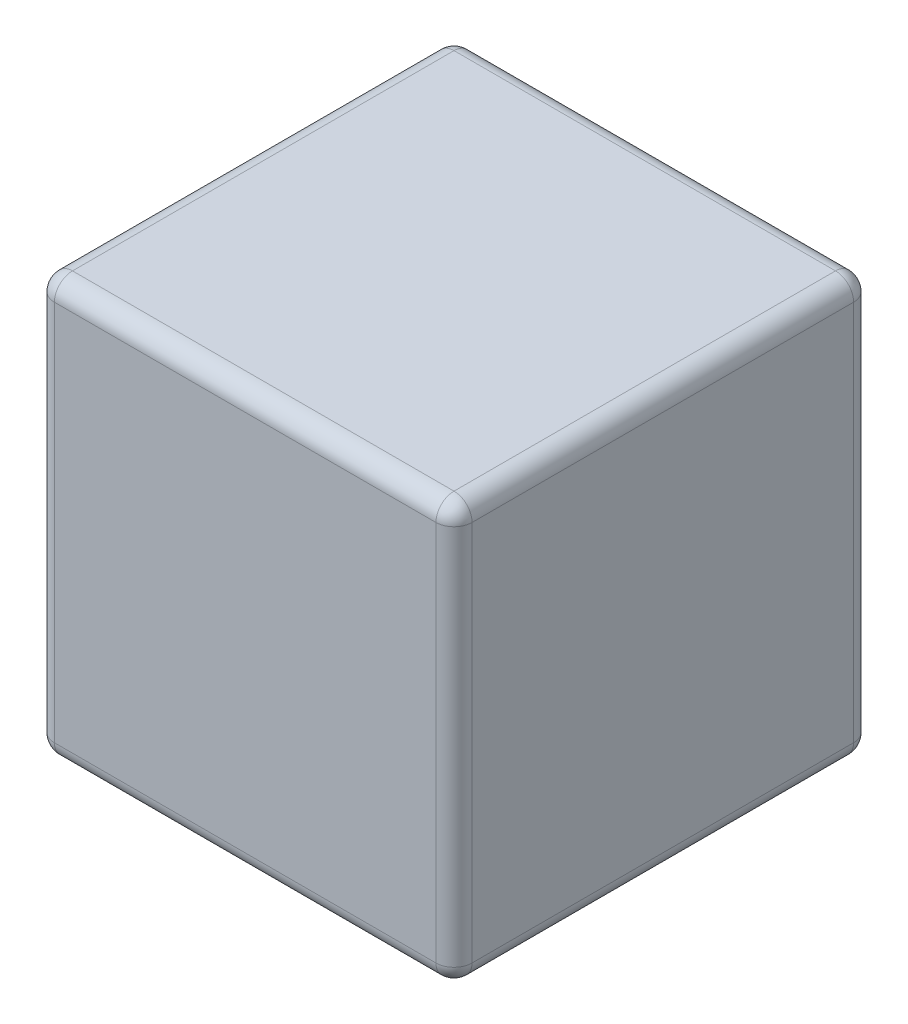
ISO-10303-21;
HEADER;
FILE_DESCRIPTION(('STEP AP214'),'2;1');
FILE_NAME('part.step','',(''),(''),'','','');
FILE_SCHEMA(('AUTOMOTIVE_DESIGN { 1 0 10303 214 1 1 1 1 }'));
ENDSEC;
DATA;
#1=APPLICATION_CONTEXT('core data for automotive mechanical design processes');
#2=APPLICATION_PROTOCOL_DEFINITION('international standard','automotive_design',2000,#1);
#3=PRODUCT_CONTEXT('',#1,'mechanical');
#4=PRODUCT('Part','Part','',(#3));
#5=PRODUCT_RELATED_PRODUCT_CATEGORY('part','',(#4));
#6=PRODUCT_DEFINITION_FORMATION('','',#4);
#7=PRODUCT_DEFINITION_CONTEXT('part definition',#1,'design');
#8=PRODUCT_DEFINITION('design','',#6,#7);
#9=PRODUCT_DEFINITION_SHAPE('','',#8);
#10=(LENGTH_UNIT() NAMED_UNIT(*) SI_UNIT(.MILLI.,.METRE.));
#11=(NAMED_UNIT(*) PLANE_ANGLE_UNIT() SI_UNIT($,.RADIAN.));
#12=(NAMED_UNIT(*) SI_UNIT($,.STERADIAN.) SOLID_ANGLE_UNIT());
#13=UNCERTAINTY_MEASURE_WITH_UNIT(LENGTH_MEASURE(1.E-05),#10,'distance_accuracy_value','');
#14=(GEOMETRIC_REPRESENTATION_CONTEXT(3) GLOBAL_UNCERTAINTY_ASSIGNED_CONTEXT((#13)) GLOBAL_UNIT_ASSIGNED_CONTEXT((#10,
#11,#12)) REPRESENTATION_CONTEXT('',''));
#15=CARTESIAN_POINT('',(0.,0.,0.));
#16=DIRECTION('',(0.,0.,1.));
#17=DIRECTION('',(1.,0.,0.));
#18=AXIS2_PLACEMENT_3D('',#15,#16,#17);
#19=CARTESIAN_POINT('',(5.775,-5.775,11.55));
#20=DIRECTION('',(-1.,0.,0.));
#21=DIRECTION('',(0.,0.,1.));
#22=AXIS2_PLACEMENT_3D('',#19,#20,#21);
#23=PLANE('',#22);
#24=DIRECTION('',(0.,1.,0.));
#25=VECTOR('',#24,1.);
#26=CARTESIAN_POINT('',(5.775,-5.775,11.05));
#27=LINE('',#26,#25);
#28=CARTESIAN_POINT('',(5.775,5.275,11.05));
#29=VERTEX_POINT('',#28);
#30=CARTESIAN_POINT('',(5.775,-5.275,11.05));
#31=VERTEX_POINT('',#30);
#32=EDGE_CURVE('E42',#29,#31,#27,.F.);
#33=ORIENTED_EDGE('',*,*,#32,.T.);
#34=DIRECTION('',(0.,0.,-1.));
#35=VECTOR('',#34,1.);
#36=CARTESIAN_POINT('',(5.775,-5.275,11.55));
#37=LINE('',#36,#35);
#38=CARTESIAN_POINT('',(5.775,-5.275,0.5));
#39=VERTEX_POINT('',#38);
#40=EDGE_CURVE('E11',#31,#39,#37,.T.);
#41=ORIENTED_EDGE('',*,*,#40,.T.);
#42=DIRECTION('',(0.,1.,0.));
#43=VECTOR('',#42,1.);
#44=CARTESIAN_POINT('',(5.775,5.775,0.5));
#45=LINE('',#44,#43);
#46=CARTESIAN_POINT('',(5.775,5.275,0.5));
#47=VERTEX_POINT('',#46);
#48=EDGE_CURVE('E195',#39,#47,#45,.T.);
#49=ORIENTED_EDGE('',*,*,#48,.T.);
#50=DIRECTION('',(0.,0.,-1.));
#51=VECTOR('',#50,1.);
#52=CARTESIAN_POINT('',(5.775,5.275,11.55));
#53=LINE('',#52,#51);
#54=EDGE_CURVE('E53',#47,#29,#53,.F.);
#55=ORIENTED_EDGE('',*,*,#54,.T.);
#56=EDGE_LOOP('',(#33,#41,#49,#55));
#57=FACE_BOUND('',#56,.T.);
#58=ADVANCED_FACE('F33',(#57),#23,.F.);
#59=CARTESIAN_POINT('',(-5.775,5.775,11.55));
#60=DIRECTION('',(0.,-1.,0.));
#61=DIRECTION('',(0.,0.,-1.));
#62=AXIS2_PLACEMENT_3D('',#59,#60,#61);
#63=PLANE('',#62);
#64=DIRECTION('',(-1.,0.,0.));
#65=VECTOR('',#64,1.);
#66=CARTESIAN_POINT('',(-5.775,5.775,0.5));
#67=LINE('',#66,#65);
#68=CARTESIAN_POINT('',(5.275,5.775,0.5));
#69=VERTEX_POINT('',#68);
#70=CARTESIAN_POINT('',(-5.275,5.775,0.5));
#71=VERTEX_POINT('',#70);
#72=EDGE_CURVE('E181',#69,#71,#67,.T.);
#73=ORIENTED_EDGE('',*,*,#72,.T.);
#74=DIRECTION('',(0.,0.,-1.));
#75=VECTOR('',#74,1.);
#76=CARTESIAN_POINT('',(-5.275,5.775,11.55));
#77=LINE('',#76,#75);
#78=CARTESIAN_POINT('',(-5.275,5.775,11.05));
#79=VERTEX_POINT('',#78);
#80=EDGE_CURVE('E183',#71,#79,#77,.F.);
#81=ORIENTED_EDGE('',*,*,#80,.T.);
#82=DIRECTION('',(-1.,0.,0.));
#83=VECTOR('',#82,1.);
#84=CARTESIAN_POINT('',(-5.775,5.775,11.05));
#85=LINE('',#84,#83);
#86=CARTESIAN_POINT('',(5.275,5.775,11.05));
#87=VERTEX_POINT('',#86);
#88=EDGE_CURVE('E179',#79,#87,#85,.F.);
#89=ORIENTED_EDGE('',*,*,#88,.T.);
#90=DIRECTION('',(0.,0.,-1.));
#91=VECTOR('',#90,1.);
#92=CARTESIAN_POINT('',(5.275,5.775,11.55));
#93=LINE('',#92,#91);
#94=EDGE_CURVE('E177',#87,#69,#93,.T.);
#95=ORIENTED_EDGE('',*,*,#94,.T.);
#96=EDGE_LOOP('',(#73,#81,#89,#95));
#97=FACE_BOUND('',#96,.T.);
#98=ADVANCED_FACE('F266',(#97),#63,.F.);
#99=CARTESIAN_POINT('',(-5.775,-5.775,11.55));
#100=DIRECTION('',(1.,0.,0.));
#101=DIRECTION('',(0.,0.,-1.));
#102=AXIS2_PLACEMENT_3D('',#99,#100,#101);
#103=PLANE('',#102);
#104=DIRECTION('',(0.,-1.,0.));
#105=VECTOR('',#104,1.);
#106=CARTESIAN_POINT('',(-5.775,-5.775,0.5));
#107=LINE('',#106,#105);
#108=CARTESIAN_POINT('',(-5.775,5.275,0.5));
#109=VERTEX_POINT('',#108);
#110=CARTESIAN_POINT('',(-5.775,-5.275,0.5));
#111=VERTEX_POINT('',#110);
#112=EDGE_CURVE('E172',#109,#111,#107,.T.);
#113=ORIENTED_EDGE('',*,*,#112,.T.);
#114=DIRECTION('',(0.,0.,-1.));
#115=VECTOR('',#114,1.);
#116=CARTESIAN_POINT('',(-5.775,-5.275,11.55));
#117=LINE('',#116,#115);
#118=CARTESIAN_POINT('',(-5.775,-5.275,11.05));
#119=VERTEX_POINT('',#118);
#120=EDGE_CURVE('E174',#111,#119,#117,.F.);
#121=ORIENTED_EDGE('',*,*,#120,.T.);
#122=DIRECTION('',(0.,-1.,0.));
#123=VECTOR('',#122,1.);
#124=CARTESIAN_POINT('',(-5.775,-5.775,11.05));
#125=LINE('',#124,#123);
#126=CARTESIAN_POINT('',(-5.775,5.275,11.05));
#127=VERTEX_POINT('',#126);
#128=EDGE_CURVE('E168',#119,#127,#125,.F.);
#129=ORIENTED_EDGE('',*,*,#128,.T.);
#130=DIRECTION('',(0.,0.,-1.));
#131=VECTOR('',#130,1.);
#132=CARTESIAN_POINT('',(-5.775,5.275,11.55));
#133=LINE('',#132,#131);
#134=EDGE_CURVE('E170',#127,#109,#133,.T.);
#135=ORIENTED_EDGE('',*,*,#134,.T.);
#136=EDGE_LOOP('',(#113,#121,#129,#135));
#137=FACE_BOUND('',#136,.T.);
#138=ADVANCED_FACE('F287',(#137),#103,.F.);
#139=CARTESIAN_POINT('',(-5.775,-5.775,11.55));
#140=DIRECTION('',(0.,1.,0.));
#141=DIRECTION('',(0.,0.,1.));
#142=AXIS2_PLACEMENT_3D('',#139,#140,#141);
#143=PLANE('',#142);
#144=DIRECTION('',(0.,0.,-1.));
#145=VECTOR('',#144,1.);
#146=CARTESIAN_POINT('',(-5.275,-5.775,11.55));
#147=LINE('',#146,#145);
#148=CARTESIAN_POINT('',(-5.275,-5.775,11.05));
#149=VERTEX_POINT('',#148);
#150=CARTESIAN_POINT('',(-5.275,-5.775,0.5));
#151=VERTEX_POINT('',#150);
#152=EDGE_CURVE('E155',#149,#151,#147,.T.);
#153=ORIENTED_EDGE('',*,*,#152,.T.);
#154=DIRECTION('',(1.,0.,0.));
#155=VECTOR('',#154,1.);
#156=CARTESIAN_POINT('',(5.775,-5.775,0.5));
#157=LINE('',#156,#155);
#158=CARTESIAN_POINT('',(5.275,-5.775,0.5));
#159=VERTEX_POINT('',#158);
#160=EDGE_CURVE('E127',#151,#159,#157,.T.);
#161=ORIENTED_EDGE('',*,*,#160,.T.);
#162=DIRECTION('',(0.,0.,-1.));
#163=VECTOR('',#162,1.);
#164=CARTESIAN_POINT('',(5.275,-5.775,11.55));
#165=LINE('',#164,#163);
#166=CARTESIAN_POINT('',(5.275,-5.775,11.05));
#167=VERTEX_POINT('',#166);
#168=EDGE_CURVE('E145',#159,#167,#165,.F.);
#169=ORIENTED_EDGE('',*,*,#168,.T.);
#170=DIRECTION('',(1.,0.,0.));
#171=VECTOR('',#170,1.);
#172=CARTESIAN_POINT('',(-5.775,-5.775,11.05));
#173=LINE('',#172,#171);
#174=EDGE_CURVE('E151',#167,#149,#173,.F.);
#175=ORIENTED_EDGE('',*,*,#174,.T.);
#176=EDGE_LOOP('',(#153,#161,#169,#175));
#177=FACE_BOUND('',#176,.T.);
#178=ADVANCED_FACE('F153',(#177),#143,.F.);
#179=CARTESIAN_POINT('',(0.,0.,11.55));
#180=DIRECTION('',(0.,0.,-1.));
#181=DIRECTION('',(-1.,0.,0.));
#182=AXIS2_PLACEMENT_3D('',#179,#180,#181);
#183=PLANE('',#182);
#184=DIRECTION('',(0.,-1.,0.));
#185=VECTOR('',#184,1.);
#186=CARTESIAN_POINT('',(-5.275,0.,11.55));
#187=LINE('',#186,#185);
#188=CARTESIAN_POINT('',(-5.275,5.275,11.55));
#189=VERTEX_POINT('',#188);
#190=CARTESIAN_POINT('',(-5.275,-5.275,11.55));
#191=VERTEX_POINT('',#190);
#192=EDGE_CURVE('E190',#189,#191,#187,.T.);
#193=ORIENTED_EDGE('',*,*,#192,.T.);
#194=DIRECTION('',(1.,0.,0.));
#195=VECTOR('',#194,1.);
#196=CARTESIAN_POINT('',(0.,-5.275,11.55));
#197=LINE('',#196,#195);
#198=CARTESIAN_POINT('',(5.275,-5.275,11.55));
#199=VERTEX_POINT('',#198);
#200=EDGE_CURVE('E192',#191,#199,#197,.T.);
#201=ORIENTED_EDGE('',*,*,#200,.T.);
#202=DIRECTION('',(0.,1.,0.));
#203=VECTOR('',#202,1.);
#204=CARTESIAN_POINT('',(5.275,0.,11.55));
#205=LINE('',#204,#203);
#206=CARTESIAN_POINT('',(5.275,5.275,11.55));
#207=VERTEX_POINT('',#206);
#208=EDGE_CURVE('E186',#199,#207,#205,.T.);
#209=ORIENTED_EDGE('',*,*,#208,.T.);
#210=DIRECTION('',(-1.,0.,0.));
#211=VECTOR('',#210,1.);
#212=CARTESIAN_POINT('',(0.,5.275,11.55));
#213=LINE('',#212,#211);
#214=EDGE_CURVE('E188',#207,#189,#213,.T.);
#215=ORIENTED_EDGE('',*,*,#214,.T.);
#216=EDGE_LOOP('',(#193,#201,#209,#215));
#217=FACE_BOUND('',#216,.T.);
#218=ADVANCED_FACE('F301',(#217),#183,.F.);
#219=CARTESIAN_POINT('',(0.,0.,0.));
#220=DIRECTION('',(0.,0.,-1.));
#221=DIRECTION('',(-1.,0.,0.));
#222=AXIS2_PLACEMENT_3D('',#219,#220,#221);
#223=PLANE('',#222);
#224=DIRECTION('',(0.,1.,0.));
#225=VECTOR('',#224,1.);
#226=CARTESIAN_POINT('',(5.275,-5.775,0.));
#227=LINE('',#226,#225);
#228=CARTESIAN_POINT('',(5.275,5.275,0.));
#229=VERTEX_POINT('',#228);
#230=CARTESIAN_POINT('',(5.275,-5.275,0.));
#231=VERTEX_POINT('',#230);
#232=EDGE_CURVE('E157',#229,#231,#227,.F.);
#233=ORIENTED_EDGE('',*,*,#232,.T.);
#234=DIRECTION('',(1.,0.,0.));
#235=VECTOR('',#234,1.);
#236=CARTESIAN_POINT('',(-5.775,-5.275,0.));
#237=LINE('',#236,#235);
#238=CARTESIAN_POINT('',(-5.275,-5.275,0.));
#239=VERTEX_POINT('',#238);
#240=EDGE_CURVE('E129',#231,#239,#237,.F.);
#241=ORIENTED_EDGE('',*,*,#240,.T.);
#242=DIRECTION('',(0.,-1.,0.));
#243=VECTOR('',#242,1.);
#244=CARTESIAN_POINT('',(-5.275,5.775,0.));
#245=LINE('',#244,#243);
#246=CARTESIAN_POINT('',(-5.275,5.275,0.));
#247=VERTEX_POINT('',#246);
#248=EDGE_CURVE('E165',#239,#247,#245,.F.);
#249=ORIENTED_EDGE('',*,*,#248,.T.);
#250=DIRECTION('',(-1.,0.,0.));
#251=VECTOR('',#250,1.);
#252=CARTESIAN_POINT('',(5.775,5.275,0.));
#253=LINE('',#252,#251);
#254=EDGE_CURVE('E159',#247,#229,#253,.F.);
#255=ORIENTED_EDGE('',*,*,#254,.T.);
#256=EDGE_LOOP('',(#233,#241,#249,#255));
#257=FACE_BOUND('',#256,.T.);
#258=ADVANCED_FACE('F320',(#257),#223,.T.);
#259=CARTESIAN_POINT('',(0.,5.275,11.05));
#260=DIRECTION('',(-1.,0.,0.));
#261=DIRECTION('',(0.,0.,1.));
#262=AXIS2_PLACEMENT_3D('',#259,#260,#261);
#263=CYLINDRICAL_SURFACE('',#262,0.5);
#264=CARTESIAN_POINT('',(-5.275,5.275,11.05));
#265=DIRECTION('',(-1.,0.,0.));
#266=DIRECTION('',(0.,0.,1.));
#267=AXIS2_PLACEMENT_3D('',#264,#265,#266);
#268=CIRCLE('',#267,0.5);
#269=EDGE_CURVE('E37',#189,#79,#268,.T.);
#270=ORIENTED_EDGE('',*,*,#269,.F.);
#271=ORIENTED_EDGE('',*,*,#214,.F.);
#272=CARTESIAN_POINT('',(5.275,5.275,11.05));
#273=DIRECTION('',(1.,0.,0.));
#274=DIRECTION('',(0.,0.,-1.));
#275=AXIS2_PLACEMENT_3D('',#272,#273,#274);
#276=CIRCLE('',#275,0.5);
#277=EDGE_CURVE('E247',#87,#207,#276,.T.);
#278=ORIENTED_EDGE('',*,*,#277,.F.);
#279=ORIENTED_EDGE('',*,*,#88,.F.);
#280=EDGE_LOOP('',(#270,#271,#278,#279));
#281=FACE_BOUND('',#280,.T.);
#282=ADVANCED_FACE('F35',(#281),#263,.T.);
#283=CARTESIAN_POINT('',(-5.275,5.275,11.05));
#284=DIRECTION('',(0.,0.,1.));
#285=DIRECTION('',(1.,0.,0.));
#286=AXIS2_PLACEMENT_3D('',#283,#284,#285);
#287=SPHERICAL_SURFACE('',#286,0.5);
#288=CARTESIAN_POINT('',(-5.275,5.275,11.05));
#289=DIRECTION('',(0.,1.,0.));
#290=DIRECTION('',(0.,0.,1.));
#291=AXIS2_PLACEMENT_3D('',#288,#289,#290);
#292=CIRCLE('',#291,0.5);
#293=EDGE_CURVE('E243',#189,#127,#292,.F.);
#294=ORIENTED_EDGE('',*,*,#293,.F.);
#295=ORIENTED_EDGE('',*,*,#269,.T.);
#296=CARTESIAN_POINT('',(-5.275,5.275,11.05));
#297=DIRECTION('',(0.,0.,1.));
#298=DIRECTION('',(1.,0.,0.));
#299=AXIS2_PLACEMENT_3D('',#296,#297,#298);
#300=CIRCLE('',#299,0.5);
#301=EDGE_CURVE('E246',#127,#79,#300,.F.);
#302=ORIENTED_EDGE('',*,*,#301,.F.);
#303=EDGE_LOOP('',(#294,#295,#302));
#304=FACE_BOUND('',#303,.T.);
#305=ADVANCED_FACE('F259',(#304),#287,.T.);
#306=CARTESIAN_POINT('',(5.275,5.275,11.05));
#307=DIRECTION('',(0.,0.,1.));
#308=DIRECTION('',(1.,0.,0.));
#309=AXIS2_PLACEMENT_3D('',#306,#307,#308);
#310=SPHERICAL_SURFACE('',#309,0.5);
#311=CARTESIAN_POINT('',(5.275,5.275,11.05));
#312=DIRECTION('',(0.,0.,1.));
#313=DIRECTION('',(1.,0.,0.));
#314=AXIS2_PLACEMENT_3D('',#311,#312,#313);
#315=CIRCLE('',#314,0.5);
#316=EDGE_CURVE('E238',#87,#29,#315,.F.);
#317=ORIENTED_EDGE('',*,*,#316,.F.);
#318=ORIENTED_EDGE('',*,*,#277,.T.);
#319=CARTESIAN_POINT('',(5.275,5.275,11.05));
#320=DIRECTION('',(0.,1.,0.));
#321=DIRECTION('',(0.,0.,1.));
#322=AXIS2_PLACEMENT_3D('',#319,#320,#321);
#323=CIRCLE('',#322,0.5);
#324=EDGE_CURVE('E240',#29,#207,#323,.F.);
#325=ORIENTED_EDGE('',*,*,#324,.F.);
#326=EDGE_LOOP('',(#317,#318,#325));
#327=FACE_BOUND('',#326,.T.);
#328=ADVANCED_FACE('F309',(#327),#310,.T.);
#329=CARTESIAN_POINT('',(-5.275,5.275,11.55));
#330=DIRECTION('',(0.,0.,-1.));
#331=DIRECTION('',(-1.,0.,0.));
#332=AXIS2_PLACEMENT_3D('',#329,#330,#331);
#333=CYLINDRICAL_SURFACE('',#332,0.5);
#334=ORIENTED_EDGE('',*,*,#301,.T.);
#335=ORIENTED_EDGE('',*,*,#80,.F.);
#336=CARTESIAN_POINT('',(-5.275,5.275,0.5));
#337=DIRECTION('',(0.,0.,-1.));
#338=DIRECTION('',(-1.,0.,0.));
#339=AXIS2_PLACEMENT_3D('',#336,#337,#338);
#340=CIRCLE('',#339,0.5);
#341=EDGE_CURVE('E232',#109,#71,#340,.T.);
#342=ORIENTED_EDGE('',*,*,#341,.F.);
#343=ORIENTED_EDGE('',*,*,#134,.F.);
#344=EDGE_LOOP('',(#334,#335,#342,#343));
#345=FACE_BOUND('',#344,.T.);
#346=ADVANCED_FACE('F271',(#345),#333,.T.);
#347=CARTESIAN_POINT('',(-5.275,0.,11.05));
#348=DIRECTION('',(0.,-1.,0.));
#349=DIRECTION('',(0.,0.,-1.));
#350=AXIS2_PLACEMENT_3D('',#347,#348,#349);
#351=CYLINDRICAL_SURFACE('',#350,0.5);
#352=ORIENTED_EDGE('',*,*,#293,.T.);
#353=ORIENTED_EDGE('',*,*,#128,.F.);
#354=CARTESIAN_POINT('',(-5.275,-5.275,11.05));
#355=DIRECTION('',(0.,-1.,0.));
#356=DIRECTION('',(0.,0.,-1.));
#357=AXIS2_PLACEMENT_3D('',#354,#355,#356);
#358=CIRCLE('',#357,0.5);
#359=EDGE_CURVE('E229',#191,#119,#358,.T.);
#360=ORIENTED_EDGE('',*,*,#359,.F.);
#361=ORIENTED_EDGE('',*,*,#192,.F.);
#362=EDGE_LOOP('',(#352,#353,#360,#361));
#363=FACE_BOUND('',#362,.T.);
#364=ADVANCED_FACE('F298',(#363),#351,.T.);
#365=CARTESIAN_POINT('',(0.,-5.275,11.05));
#366=DIRECTION('',(1.,0.,0.));
#367=DIRECTION('',(0.,0.,-1.));
#368=AXIS2_PLACEMENT_3D('',#365,#366,#367);
#369=CYLINDRICAL_SURFACE('',#368,0.5);
#370=CARTESIAN_POINT('',(5.275,-5.275,11.05));
#371=DIRECTION('',(1.,0.,0.));
#372=DIRECTION('',(0.,0.,-1.));
#373=AXIS2_PLACEMENT_3D('',#370,#371,#372);
#374=CIRCLE('',#373,0.5);
#375=EDGE_CURVE('E223',#199,#167,#374,.T.);
#376=ORIENTED_EDGE('',*,*,#375,.F.);
#377=ORIENTED_EDGE('',*,*,#200,.F.);
#378=CARTESIAN_POINT('',(-5.275,-5.275,11.05));
#379=DIRECTION('',(-1.,0.,0.));
#380=DIRECTION('',(0.,0.,1.));
#381=AXIS2_PLACEMENT_3D('',#378,#379,#380);
#382=CIRCLE('',#381,0.5);
#383=EDGE_CURVE('E226',#149,#191,#382,.T.);
#384=ORIENTED_EDGE('',*,*,#383,.F.);
#385=ORIENTED_EDGE('',*,*,#174,.F.);
#386=EDGE_LOOP('',(#376,#377,#384,#385));
#387=FACE_BOUND('',#386,.T.);
#388=ADVANCED_FACE('F304',(#387),#369,.T.);
#389=CARTESIAN_POINT('',(5.275,0.,11.05));
#390=DIRECTION('',(0.,1.,0.));
#391=DIRECTION('',(0.,0.,1.));
#392=AXIS2_PLACEMENT_3D('',#389,#390,#391);
#393=CYLINDRICAL_SURFACE('',#392,0.5);
#394=ORIENTED_EDGE('',*,*,#324,.T.);
#395=ORIENTED_EDGE('',*,*,#208,.F.);
#396=CARTESIAN_POINT('',(5.275,-5.275,11.05));
#397=DIRECTION('',(0.,-1.,0.));
#398=DIRECTION('',(0.,0.,-1.));
#399=AXIS2_PLACEMENT_3D('',#396,#397,#398);
#400=CIRCLE('',#399,0.5);
#401=EDGE_CURVE('E221',#31,#199,#400,.T.);
#402=ORIENTED_EDGE('',*,*,#401,.F.);
#403=ORIENTED_EDGE('',*,*,#32,.F.);
#404=EDGE_LOOP('',(#394,#395,#402,#403));
#405=FACE_BOUND('',#404,.T.);
#406=ADVANCED_FACE('F308',(#405),#393,.T.);
#407=CARTESIAN_POINT('',(5.275,5.275,11.55));
#408=DIRECTION('',(0.,0.,-1.));
#409=DIRECTION('',(-1.,0.,0.));
#410=AXIS2_PLACEMENT_3D('',#407,#408,#409);
#411=CYLINDRICAL_SURFACE('',#410,0.5);
#412=ORIENTED_EDGE('',*,*,#316,.T.);
#413=ORIENTED_EDGE('',*,*,#54,.F.);
#414=CARTESIAN_POINT('',(5.275,5.275,0.5));
#415=DIRECTION('',(0.,0.,-1.));
#416=DIRECTION('',(-1.,0.,0.));
#417=AXIS2_PLACEMENT_3D('',#414,#415,#416);
#418=CIRCLE('',#417,0.5);
#419=EDGE_CURVE('E218',#69,#47,#418,.T.);
#420=ORIENTED_EDGE('',*,*,#419,.F.);
#421=ORIENTED_EDGE('',*,*,#94,.F.);
#422=EDGE_LOOP('',(#412,#413,#420,#421));
#423=FACE_BOUND('',#422,.T.);
#424=ADVANCED_FACE('F312',(#423),#411,.T.);
#425=CARTESIAN_POINT('',(-5.775,5.275,0.5));
#426=DIRECTION('',(1.,0.,0.));
#427=DIRECTION('',(0.,0.,-1.));
#428=AXIS2_PLACEMENT_3D('',#425,#426,#427);
#429=CYLINDRICAL_SURFACE('',#428,0.5);
#430=CARTESIAN_POINT('',(-5.275,5.275,0.5));
#431=DIRECTION('',(-1.,0.,0.));
#432=DIRECTION('',(0.,0.,1.));
#433=AXIS2_PLACEMENT_3D('',#430,#431,#432);
#434=CIRCLE('',#433,0.5);
#435=EDGE_CURVE('E235',#71,#247,#434,.T.);
#436=ORIENTED_EDGE('',*,*,#435,.F.);
#437=ORIENTED_EDGE('',*,*,#72,.F.);
#438=CARTESIAN_POINT('',(5.275,5.275,0.5));
#439=DIRECTION('',(1.,0.,0.));
#440=DIRECTION('',(0.,1.,0.));
#441=AXIS2_PLACEMENT_3D('',#438,#439,#440);
#442=CIRCLE('',#441,0.5);
#443=EDGE_CURVE('E215',#229,#69,#442,.T.);
#444=ORIENTED_EDGE('',*,*,#443,.F.);
#445=ORIENTED_EDGE('',*,*,#254,.F.);
#446=EDGE_LOOP('',(#436,#437,#444,#445));
#447=FACE_BOUND('',#446,.T.);
#448=ADVANCED_FACE('F275',(#447),#429,.T.);
#449=CARTESIAN_POINT('',(-5.275,5.275,0.5));
#450=DIRECTION('',(0.,0.,1.));
#451=DIRECTION('',(1.,0.,0.));
#452=AXIS2_PLACEMENT_3D('',#449,#450,#451);
#453=SPHERICAL_SURFACE('',#452,0.5);
#454=ORIENTED_EDGE('',*,*,#341,.T.);
#455=ORIENTED_EDGE('',*,*,#435,.T.);
#456=CARTESIAN_POINT('',(-5.275,5.275,0.5));
#457=DIRECTION('',(0.,1.,0.));
#458=DIRECTION('',(-1.,0.,0.));
#459=AXIS2_PLACEMENT_3D('',#456,#457,#458);
#460=CIRCLE('',#459,0.5);
#461=EDGE_CURVE('E212',#109,#247,#460,.F.);
#462=ORIENTED_EDGE('',*,*,#461,.F.);
#463=EDGE_LOOP('',(#454,#455,#462));
#464=FACE_BOUND('',#463,.T.);
#465=ADVANCED_FACE('F279',(#464),#453,.T.);
#466=CARTESIAN_POINT('',(-5.275,-5.275,11.05));
#467=DIRECTION('',(0.,0.,1.));
#468=DIRECTION('',(1.,0.,0.));
#469=AXIS2_PLACEMENT_3D('',#466,#467,#468);
#470=SPHERICAL_SURFACE('',#469,0.5);
#471=ORIENTED_EDGE('',*,*,#383,.T.);
#472=ORIENTED_EDGE('',*,*,#359,.T.);
#473=CARTESIAN_POINT('',(-5.275,-5.275,11.05));
#474=DIRECTION('',(0.,0.,1.));
#475=DIRECTION('',(1.,0.,0.));
#476=AXIS2_PLACEMENT_3D('',#473,#474,#475);
#477=CIRCLE('',#476,0.5);
#478=EDGE_CURVE('E210',#149,#119,#477,.F.);
#479=ORIENTED_EDGE('',*,*,#478,.F.);
#480=EDGE_LOOP('',(#471,#472,#479));
#481=FACE_BOUND('',#480,.T.);
#482=ADVANCED_FACE('F295',(#481),#470,.T.);
#483=CARTESIAN_POINT('',(5.275,-5.275,11.05));
#484=DIRECTION('',(0.,0.,1.));
#485=DIRECTION('',(1.,0.,0.));
#486=AXIS2_PLACEMENT_3D('',#483,#484,#485);
#487=SPHERICAL_SURFACE('',#486,0.5);
#488=ORIENTED_EDGE('',*,*,#401,.T.);
#489=ORIENTED_EDGE('',*,*,#375,.T.);
#490=CARTESIAN_POINT('',(5.275,-5.275,11.05));
#491=DIRECTION('',(0.,0.,1.));
#492=DIRECTION('',(1.,0.,0.));
#493=AXIS2_PLACEMENT_3D('',#490,#491,#492);
#494=CIRCLE('',#493,0.5);
#495=EDGE_CURVE('E148',#31,#167,#494,.F.);
#496=ORIENTED_EDGE('',*,*,#495,.F.);
#497=EDGE_LOOP('',(#488,#489,#496));
#498=FACE_BOUND('',#497,.T.);
#499=ADVANCED_FACE('F355',(#498),#487,.T.);
#500=CARTESIAN_POINT('',(5.275,5.275,0.5));
#501=DIRECTION('',(0.,0.,1.));
#502=DIRECTION('',(1.,0.,0.));
#503=AXIS2_PLACEMENT_3D('',#500,#501,#502);
#504=SPHERICAL_SURFACE('',#503,0.5);
#505=ORIENTED_EDGE('',*,*,#443,.T.);
#506=ORIENTED_EDGE('',*,*,#419,.T.);
#507=CARTESIAN_POINT('',(5.275,5.275,0.5));
#508=DIRECTION('',(0.,1.,0.));
#509=DIRECTION('',(0.,0.,1.));
#510=AXIS2_PLACEMENT_3D('',#507,#508,#509);
#511=CIRCLE('',#510,0.5);
#512=EDGE_CURVE('E206',#229,#47,#511,.F.);
#513=ORIENTED_EDGE('',*,*,#512,.F.);
#514=EDGE_LOOP('',(#505,#506,#513));
#515=FACE_BOUND('',#514,.T.);
#516=ADVANCED_FACE('F315',(#515),#504,.T.);
#517=CARTESIAN_POINT('',(-5.275,-5.775,0.5));
#518=DIRECTION('',(0.,1.,0.));
#519=DIRECTION('',(0.,0.,1.));
#520=AXIS2_PLACEMENT_3D('',#517,#518,#519);
#521=CYLINDRICAL_SURFACE('',#520,0.5);
#522=ORIENTED_EDGE('',*,*,#461,.T.);
#523=ORIENTED_EDGE('',*,*,#248,.F.);
#524=CARTESIAN_POINT('',(-5.275,-5.275,0.5));
#525=DIRECTION('',(0.,-1.,0.));
#526=DIRECTION('',(0.,0.,-1.));
#527=AXIS2_PLACEMENT_3D('',#524,#525,#526);
#528=CIRCLE('',#527,0.5);
#529=EDGE_CURVE('E203',#111,#239,#528,.T.);
#530=ORIENTED_EDGE('',*,*,#529,.F.);
#531=ORIENTED_EDGE('',*,*,#112,.F.);
#532=EDGE_LOOP('',(#522,#523,#530,#531));
#533=FACE_BOUND('',#532,.T.);
#534=ADVANCED_FACE('F284',(#533),#521,.T.);
#535=CARTESIAN_POINT('',(-5.275,-5.275,11.55));
#536=DIRECTION('',(0.,0.,-1.));
#537=DIRECTION('',(-1.,0.,0.));
#538=AXIS2_PLACEMENT_3D('',#535,#536,#537);
#539=CYLINDRICAL_SURFACE('',#538,0.5);
#540=ORIENTED_EDGE('',*,*,#478,.T.);
#541=ORIENTED_EDGE('',*,*,#120,.F.);
#542=CARTESIAN_POINT('',(-5.275,-5.275,0.5));
#543=DIRECTION('',(0.,0.,-1.));
#544=DIRECTION('',(-1.,0.,0.));
#545=AXIS2_PLACEMENT_3D('',#542,#543,#544);
#546=CIRCLE('',#545,0.5);
#547=EDGE_CURVE('E142',#151,#111,#546,.T.);
#548=ORIENTED_EDGE('',*,*,#547,.F.);
#549=ORIENTED_EDGE('',*,*,#152,.F.);
#550=EDGE_LOOP('',(#540,#541,#548,#549));
#551=FACE_BOUND('',#550,.T.);
#552=ADVANCED_FACE('F289',(#551),#539,.T.);
#553=CARTESIAN_POINT('',(5.275,-5.275,11.55));
#554=DIRECTION('',(0.,0.,-1.));
#555=DIRECTION('',(-1.,0.,0.));
#556=AXIS2_PLACEMENT_3D('',#553,#554,#555);
#557=CYLINDRICAL_SURFACE('',#556,0.5);
#558=ORIENTED_EDGE('',*,*,#495,.T.);
#559=ORIENTED_EDGE('',*,*,#168,.F.);
#560=CARTESIAN_POINT('',(5.275,-5.275,0.5));
#561=DIRECTION('',(0.,0.,-1.));
#562=DIRECTION('',(-1.,0.,0.));
#563=AXIS2_PLACEMENT_3D('',#560,#561,#562);
#564=CIRCLE('',#563,0.5);
#565=EDGE_CURVE('E134',#39,#159,#564,.T.);
#566=ORIENTED_EDGE('',*,*,#565,.F.);
#567=ORIENTED_EDGE('',*,*,#40,.F.);
#568=EDGE_LOOP('',(#558,#559,#566,#567));
#569=FACE_BOUND('',#568,.T.);
#570=ADVANCED_FACE('F146',(#569),#557,.T.);
#571=CARTESIAN_POINT('',(5.275,-5.775,0.5));
#572=DIRECTION('',(0.,-1.,0.));
#573=DIRECTION('',(0.,0.,-1.));
#574=AXIS2_PLACEMENT_3D('',#571,#572,#573);
#575=CYLINDRICAL_SURFACE('',#574,0.5);
#576=ORIENTED_EDGE('',*,*,#512,.T.);
#577=ORIENTED_EDGE('',*,*,#48,.F.);
#578=CARTESIAN_POINT('',(5.275,-5.275,0.5));
#579=DIRECTION('',(0.,-1.,0.));
#580=DIRECTION('',(0.,0.,-1.));
#581=AXIS2_PLACEMENT_3D('',#578,#579,#580);
#582=CIRCLE('',#581,0.5);
#583=EDGE_CURVE('E138',#231,#39,#582,.T.);
#584=ORIENTED_EDGE('',*,*,#583,.F.);
#585=ORIENTED_EDGE('',*,*,#232,.F.);
#586=EDGE_LOOP('',(#576,#577,#584,#585));
#587=FACE_BOUND('',#586,.T.);
#588=ADVANCED_FACE('F318',(#587),#575,.T.);
#589=CARTESIAN_POINT('',(-5.275,-5.275,0.5));
#590=DIRECTION('',(0.,0.,1.));
#591=DIRECTION('',(1.,0.,0.));
#592=AXIS2_PLACEMENT_3D('',#589,#590,#591);
#593=SPHERICAL_SURFACE('',#592,0.5);
#594=ORIENTED_EDGE('',*,*,#547,.T.);
#595=ORIENTED_EDGE('',*,*,#529,.T.);
#596=CARTESIAN_POINT('',(-5.275,-5.275,0.5));
#597=DIRECTION('',(-1.,0.,0.));
#598=DIRECTION('',(0.,0.,1.));
#599=AXIS2_PLACEMENT_3D('',#596,#597,#598);
#600=CIRCLE('',#599,0.5);
#601=EDGE_CURVE('E131',#151,#239,#600,.F.);
#602=ORIENTED_EDGE('',*,*,#601,.F.);
#603=EDGE_LOOP('',(#594,#595,#602));
#604=FACE_BOUND('',#603,.T.);
#605=ADVANCED_FACE('F341',(#604),#593,.T.);
#606=CARTESIAN_POINT('',(5.275,-5.275,0.5));
#607=DIRECTION('',(0.,0.,1.));
#608=DIRECTION('',(1.,0.,0.));
#609=AXIS2_PLACEMENT_3D('',#606,#607,#608);
#610=SPHERICAL_SURFACE('',#609,0.5);
#611=ORIENTED_EDGE('',*,*,#583,.T.);
#612=ORIENTED_EDGE('',*,*,#565,.T.);
#613=CARTESIAN_POINT('',(5.275,-5.275,0.5));
#614=DIRECTION('',(1.,0.,0.));
#615=DIRECTION('',(0.,0.,-1.));
#616=AXIS2_PLACEMENT_3D('',#613,#614,#615);
#617=CIRCLE('',#616,0.5);
#618=EDGE_CURVE('E123',#231,#159,#617,.F.);
#619=ORIENTED_EDGE('',*,*,#618,.F.);
#620=EDGE_LOOP('',(#611,#612,#619));
#621=FACE_BOUND('',#620,.T.);
#622=ADVANCED_FACE('F136',(#621),#610,.T.);
#623=CARTESIAN_POINT('',(-5.775,-5.275,0.5));
#624=DIRECTION('',(-1.,0.,0.));
#625=DIRECTION('',(0.,0.,1.));
#626=AXIS2_PLACEMENT_3D('',#623,#624,#625);
#627=CYLINDRICAL_SURFACE('',#626,0.5);
#628=ORIENTED_EDGE('',*,*,#601,.T.);
#629=ORIENTED_EDGE('',*,*,#240,.F.);
#630=ORIENTED_EDGE('',*,*,#618,.T.);
#631=ORIENTED_EDGE('',*,*,#160,.F.);
#632=EDGE_LOOP('',(#628,#629,#630,#631));
#633=FACE_BOUND('',#632,.T.);
#634=ADVANCED_FACE('F125',(#633),#627,.T.);
#635=CLOSED_SHELL('',(#58,#98,#138,#178,#218,#258,#282,#305,#328,#346,#364,#388,#406,#424,#448,
#465,#482,#499,#516,#534,#552,#570,#588,#605,#622,#634));
#636=MANIFOLD_SOLID_BREP('B2',#635);
#637=ADVANCED_BREP_SHAPE_REPRESENTATION('',(#18,#636),#14);
#638=SHAPE_DEFINITION_REPRESENTATION(#9,#637);
ENDSEC;
END-ISO-10303-21;
